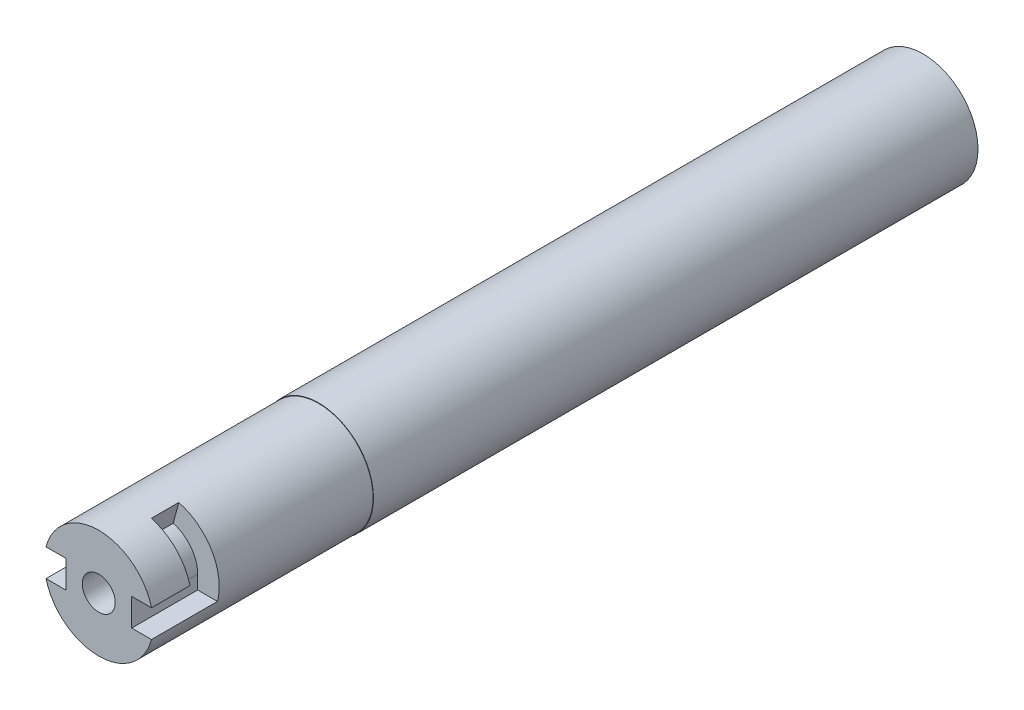
ISO-10303-21;
HEADER;
FILE_DESCRIPTION(('STEP AP214'),'2;1');
FILE_NAME('part.step','',(''),(''),'','','');
FILE_SCHEMA(('AUTOMOTIVE_DESIGN { 1 0 10303 214 1 1 1 1 }'));
ENDSEC;
DATA;
#1=APPLICATION_CONTEXT('core data for automotive mechanical design processes');
#2=APPLICATION_PROTOCOL_DEFINITION('international standard','automotive_design',2000,#1);
#3=PRODUCT_CONTEXT('',#1,'mechanical');
#4=PRODUCT('Part','Part','',(#3));
#5=PRODUCT_RELATED_PRODUCT_CATEGORY('part','',(#4));
#6=PRODUCT_DEFINITION_FORMATION('','',#4);
#7=PRODUCT_DEFINITION_CONTEXT('part definition',#1,'design');
#8=PRODUCT_DEFINITION('design','',#6,#7);
#9=PRODUCT_DEFINITION_SHAPE('','',#8);
#10=(LENGTH_UNIT() NAMED_UNIT(*) SI_UNIT(.MILLI.,.METRE.));
#11=(NAMED_UNIT(*) PLANE_ANGLE_UNIT() SI_UNIT($,.RADIAN.));
#12=(NAMED_UNIT(*) SI_UNIT($,.STERADIAN.) SOLID_ANGLE_UNIT());
#13=UNCERTAINTY_MEASURE_WITH_UNIT(LENGTH_MEASURE(1.E-05),#10,'distance_accuracy_value','');
#14=(GEOMETRIC_REPRESENTATION_CONTEXT(3) GLOBAL_UNCERTAINTY_ASSIGNED_CONTEXT((#13)) GLOBAL_UNIT_ASSIGNED_CONTEXT((#10,
#11,#12)) REPRESENTATION_CONTEXT('',''));
#15=CARTESIAN_POINT('',(0.,0.,0.));
#16=DIRECTION('',(0.,0.,1.));
#17=DIRECTION('',(1.,0.,0.));
#18=AXIS2_PLACEMENT_3D('',#15,#16,#17);
#19=CARTESIAN_POINT('',(0.,0.,95.25));
#20=DIRECTION('',(0.,0.,-1.));
#21=DIRECTION('',(-1.,0.,0.));
#22=AXIS2_PLACEMENT_3D('',#19,#20,#21);
#23=CYLINDRICAL_SURFACE('',#22,6.35);
#24=CARTESIAN_POINT('',(0.,0.,0.));
#25=DIRECTION('',(0.,0.,1.));
#26=DIRECTION('',(1.,0.,0.));
#27=AXIS2_PLACEMENT_3D('',#24,#25,#26);
#28=CIRCLE('',#27,6.35);
#29=CARTESIAN_POINT('',(6.35,0.,0.));
#30=VERTEX_POINT('',#29);
#31=EDGE_CURVE('E200',#30,#30,#28,.T.);
#32=ORIENTED_EDGE('',*,*,#31,.T.);
#33=EDGE_LOOP('',(#32));
#34=FACE_BOUND('',#33,.T.);
#35=CARTESIAN_POINT('',(0.,0.,69.85));
#36=DIRECTION('',(0.,0.,1.));
#37=DIRECTION('',(1.,0.,0.));
#38=AXIS2_PLACEMENT_3D('',#35,#36,#37);
#39=CIRCLE('',#38,6.35);
#40=CARTESIAN_POINT('',(6.35,0.,69.85));
#41=VERTEX_POINT('',#40);
#42=EDGE_CURVE('E316',#41,#41,#39,.T.);
#43=ORIENTED_EDGE('',*,*,#42,.F.);
#44=EDGE_LOOP('',(#43));
#45=FACE_BOUND('',#44,.T.);
#46=ADVANCED_FACE('F35',(#34,#45),#23,.T.);
#47=CARTESIAN_POINT('',(0.,1.5875,87.63));
#48=DIRECTION('',(0.,1.,0.));
#49=DIRECTION('',(0.,0.,1.));
#50=AXIS2_PLACEMENT_3D('',#47,#48,#49);
#51=PLANE('',#50);
#52=DIRECTION('',(0.,0.,1.));
#53=VECTOR('',#52,1.);
#54=CARTESIAN_POINT('',(6.09588093633726,1.5875,69.85));
#55=LINE('',#54,#53);
#56=CARTESIAN_POINT('',(6.09588093633726,1.5875,95.25));
#57=VERTEX_POINT('',#56);
#58=CARTESIAN_POINT('',(6.09588093633726,1.5875,90.805));
#59=VERTEX_POINT('',#58);
#60=EDGE_CURVE('E137',#57,#59,#55,.F.);
#61=ORIENTED_EDGE('',*,*,#60,.F.);
#62=DIRECTION('',(-1.,0.,0.));
#63=VECTOR('',#62,1.);
#64=CARTESIAN_POINT('',(0.,1.5875,95.25));
#65=LINE('',#64,#63);
#66=CARTESIAN_POINT('',(3.81,1.5875,95.25));
#67=VERTEX_POINT('',#66);
#68=EDGE_CURVE('E151',#57,#67,#65,.T.);
#69=ORIENTED_EDGE('',*,*,#68,.T.);
#70=DIRECTION('',(0.,0.,1.));
#71=VECTOR('',#70,1.);
#72=CARTESIAN_POINT('',(3.81,1.5875,87.63));
#73=LINE('',#72,#71);
#74=CARTESIAN_POINT('',(3.81,1.5875,90.805));
#75=VERTEX_POINT('',#74);
#76=EDGE_CURVE('E167',#75,#67,#73,.T.);
#77=ORIENTED_EDGE('',*,*,#76,.F.);
#78=DIRECTION('',(-1.,0.,0.));
#79=VECTOR('',#78,1.);
#80=CARTESIAN_POINT('',(0.,1.5875,90.805));
#81=LINE('',#80,#79);
#82=EDGE_CURVE('E152',#59,#75,#81,.T.);
#83=ORIENTED_EDGE('',*,*,#82,.F.);
#84=EDGE_LOOP('',(#61,#69,#77,#83));
#85=FACE_BOUND('',#84,.T.);
#86=ADVANCED_FACE('F149',(#85),#51,.F.);
#87=CARTESIAN_POINT('',(0.,0.,95.25));
#88=DIRECTION('',(0.,0.,1.));
#89=DIRECTION('',(1.,0.,0.));
#90=AXIS2_PLACEMENT_3D('',#87,#88,#89);
#91=PLANE('',#90);
#92=CARTESIAN_POINT('',(0.,0.,95.25));
#93=DIRECTION('',(0.,0.,1.));
#94=DIRECTION('',(1.,0.,0.));
#95=AXIS2_PLACEMENT_3D('',#92,#93,#94);
#96=CIRCLE('',#95,1.905);
#97=CARTESIAN_POINT('',(1.905,0.,95.25));
#98=VERTEX_POINT('',#97);
#99=EDGE_CURVE('E169',#98,#98,#96,.T.);
#100=ORIENTED_EDGE('',*,*,#99,.F.);
#101=EDGE_LOOP('',(#100));
#102=FACE_BOUND('',#101,.T.);
#103=ORIENTED_EDGE('',*,*,#68,.F.);
#104=CARTESIAN_POINT('',(0.,0.,95.25));
#105=DIRECTION('',(0.,0.,1.));
#106=DIRECTION('',(1.,0.,0.));
#107=AXIS2_PLACEMENT_3D('',#104,#105,#106);
#108=CIRCLE('',#107,6.2992);
#109=CARTESIAN_POINT('',(-6.09588093633726,1.5875,95.25));
#110=VERTEX_POINT('',#109);
#111=EDGE_CURVE('E134',#57,#110,#108,.T.);
#112=ORIENTED_EDGE('',*,*,#111,.T.);
#113=DIRECTION('',(1.,0.,0.));
#114=VECTOR('',#113,1.);
#115=CARTESIAN_POINT('',(0.,1.5875,95.25));
#116=LINE('',#115,#114);
#117=CARTESIAN_POINT('',(-3.81,1.5875,95.25));
#118=VERTEX_POINT('',#117);
#119=EDGE_CURVE('E182',#110,#118,#116,.T.);
#120=ORIENTED_EDGE('',*,*,#119,.T.);
#121=DIRECTION('',(0.,-1.,0.));
#122=VECTOR('',#121,1.);
#123=CARTESIAN_POINT('',(-3.81,0.,95.25));
#124=LINE('',#123,#122);
#125=CARTESIAN_POINT('',(-3.81,-1.5875,95.25));
#126=VERTEX_POINT('',#125);
#127=EDGE_CURVE('E179',#118,#126,#124,.T.);
#128=ORIENTED_EDGE('',*,*,#127,.T.);
#129=DIRECTION('',(-1.,0.,0.));
#130=VECTOR('',#129,1.);
#131=CARTESIAN_POINT('',(0.,-1.5875,95.25));
#132=LINE('',#131,#130);
#133=CARTESIAN_POINT('',(-6.09588093633726,-1.5875,95.25));
#134=VERTEX_POINT('',#133);
#135=EDGE_CURVE('E176',#126,#134,#132,.T.);
#136=ORIENTED_EDGE('',*,*,#135,.T.);
#137=CARTESIAN_POINT('',(6.09588093633726,-1.5875,95.25));
#138=VERTEX_POINT('',#137);
#139=EDGE_CURVE('E145',#134,#138,#108,.T.);
#140=ORIENTED_EDGE('',*,*,#139,.T.);
#141=DIRECTION('',(1.,0.,0.));
#142=VECTOR('',#141,1.);
#143=CARTESIAN_POINT('',(0.,-1.5875,95.25));
#144=LINE('',#143,#142);
#145=CARTESIAN_POINT('',(3.81,-1.5875,95.25));
#146=VERTEX_POINT('',#145);
#147=EDGE_CURVE('E159',#146,#138,#144,.T.);
#148=ORIENTED_EDGE('',*,*,#147,.F.);
#149=DIRECTION('',(0.,-1.,0.));
#150=VECTOR('',#149,1.);
#151=CARTESIAN_POINT('',(3.81,0.,95.25));
#152=LINE('',#151,#150);
#153=EDGE_CURVE('E56',#67,#146,#152,.T.);
#154=ORIENTED_EDGE('',*,*,#153,.F.);
#155=EDGE_LOOP('',(#103,#112,#120,#128,#136,#140,#148,#154));
#156=FACE_BOUND('',#155,.T.);
#157=ADVANCED_FACE('F156',(#102,#156),#91,.T.);
#158=CARTESIAN_POINT('',(0.,-1.5875,87.63));
#159=DIRECTION('',(0.,1.,0.));
#160=DIRECTION('',(-1.,0.,0.));
#161=AXIS2_PLACEMENT_3D('',#158,#159,#160);
#162=PLANE('',#161);
#163=DIRECTION('',(1.,0.,0.));
#164=VECTOR('',#163,1.);
#165=CARTESIAN_POINT('',(0.,-1.5875,90.805));
#166=LINE('',#165,#164);
#167=CARTESIAN_POINT('',(-6.09588093633726,-1.5875,90.805));
#168=VERTEX_POINT('',#167);
#169=CARTESIAN_POINT('',(-3.81,-1.5875,90.805));
#170=VERTEX_POINT('',#169);
#171=EDGE_CURVE('E42',#168,#170,#166,.T.);
#172=ORIENTED_EDGE('',*,*,#171,.F.);
#173=DIRECTION('',(0.,0.,1.));
#174=VECTOR('',#173,1.);
#175=CARTESIAN_POINT('',(-6.09588093633726,-1.5875,69.85));
#176=LINE('',#175,#174);
#177=EDGE_CURVE('E224',#168,#134,#176,.T.);
#178=ORIENTED_EDGE('',*,*,#177,.T.);
#179=ORIENTED_EDGE('',*,*,#135,.F.);
#180=DIRECTION('',(0.,0.,1.));
#181=VECTOR('',#180,1.);
#182=CARTESIAN_POINT('',(-3.81,-1.5875,87.63));
#183=LINE('',#182,#181);
#184=EDGE_CURVE('E187',#170,#126,#183,.T.);
#185=ORIENTED_EDGE('',*,*,#184,.F.);
#186=EDGE_LOOP('',(#172,#178,#179,#185));
#187=FACE_BOUND('',#186,.T.);
#188=ADVANCED_FACE('F223',(#187),#162,.T.);
#189=CARTESIAN_POINT('',(0.,1.5875,87.63));
#190=DIRECTION('',(0.,-1.,0.));
#191=DIRECTION('',(1.,0.,0.));
#192=AXIS2_PLACEMENT_3D('',#189,#190,#191);
#193=PLANE('',#192);
#194=ORIENTED_EDGE('',*,*,#119,.F.);
#195=DIRECTION('',(0.,0.,1.));
#196=VECTOR('',#195,1.);
#197=CARTESIAN_POINT('',(-6.09588093633726,1.5875,69.85));
#198=LINE('',#197,#196);
#199=CARTESIAN_POINT('',(-6.09588093633726,1.5875,87.63));
#200=VERTEX_POINT('',#199);
#201=EDGE_CURVE('E140',#110,#200,#198,.F.);
#202=ORIENTED_EDGE('',*,*,#201,.T.);
#203=DIRECTION('',(1.,0.,0.));
#204=VECTOR('',#203,1.);
#205=CARTESIAN_POINT('',(0.,1.5875,87.63));
#206=LINE('',#205,#204);
#207=CARTESIAN_POINT('',(-3.81,1.5875,87.63));
#208=VERTEX_POINT('',#207);
#209=EDGE_CURVE('E175',#200,#208,#206,.T.);
#210=ORIENTED_EDGE('',*,*,#209,.T.);
#211=DIRECTION('',(0.,0.,1.));
#212=VECTOR('',#211,1.);
#213=CARTESIAN_POINT('',(-3.81,1.5875,87.63));
#214=LINE('',#213,#212);
#215=EDGE_CURVE('E178',#208,#118,#214,.T.);
#216=ORIENTED_EDGE('',*,*,#215,.T.);
#217=EDGE_LOOP('',(#194,#202,#210,#216));
#218=FACE_BOUND('',#217,.T.);
#219=ADVANCED_FACE('F229',(#218),#193,.T.);
#220=CARTESIAN_POINT('',(0.,0.,87.63));
#221=DIRECTION('',(0.,0.,1.));
#222=DIRECTION('',(1.,0.,0.));
#223=AXIS2_PLACEMENT_3D('',#220,#221,#222);
#224=PLANE('',#223);
#225=ORIENTED_EDGE('',*,*,#209,.F.);
#226=CARTESIAN_POINT('',(0.,0.,87.63));
#227=DIRECTION('',(0.,0.,1.));
#228=DIRECTION('',(1.,0.,0.));
#229=AXIS2_PLACEMENT_3D('',#226,#227,#228);
#230=CIRCLE('',#229,6.2992);
#231=CARTESIAN_POINT('',(-1.63035292890977,-6.08455996496011,87.63));
#232=VERTEX_POINT('',#231);
#233=EDGE_CURVE('E235',#200,#232,#230,.T.);
#234=ORIENTED_EDGE('',*,*,#233,.T.);
#235=DIRECTION('',(-0.258819045102518,-0.965925826289069,0.));
#236=VECTOR('',#235,1.);
#237=CARTESIAN_POINT('',(-1.59131293903932,-5.9388607392366,87.63));
#238=LINE('',#237,#236);
#239=CARTESIAN_POINT('',(-0.98610056184058,-3.68017739816134,87.63));
#240=VERTEX_POINT('',#239);
#241=EDGE_CURVE('E238',#240,#232,#238,.T.);
#242=ORIENTED_EDGE('',*,*,#241,.F.);
#243=CARTESIAN_POINT('',(0.,0.,87.63));
#244=DIRECTION('',(0.,0.,-1.));
#245=DIRECTION('',(-1.,0.,0.));
#246=AXIS2_PLACEMENT_3D('',#243,#244,#245);
#247=CIRCLE('',#246,3.80999999999999);
#248=CARTESIAN_POINT('',(-3.80999999999998,0.,87.63));
#249=VERTEX_POINT('',#248);
#250=EDGE_CURVE('E237',#240,#249,#247,.T.);
#251=ORIENTED_EDGE('',*,*,#250,.T.);
#252=DIRECTION('',(0.,-1.,0.));
#253=VECTOR('',#252,1.);
#254=CARTESIAN_POINT('',(-3.81,0.,87.63));
#255=LINE('',#254,#253);
#256=EDGE_CURVE('E172',#208,#249,#255,.T.);
#257=ORIENTED_EDGE('',*,*,#256,.F.);
#258=EDGE_LOOP('',(#225,#234,#242,#251,#257));
#259=FACE_BOUND('',#258,.T.);
#260=ADVANCED_FACE('F233',(#259),#224,.T.);
#261=CARTESIAN_POINT('',(0.,-1.5875,87.63));
#262=DIRECTION('',(0.,-1.,0.));
#263=DIRECTION('',(0.,0.,-1.));
#264=AXIS2_PLACEMENT_3D('',#261,#262,#263);
#265=PLANE('',#264);
#266=DIRECTION('',(0.,0.,1.));
#267=VECTOR('',#266,1.);
#268=CARTESIAN_POINT('',(6.09588093633726,-1.5875,69.85));
#269=LINE('',#268,#267);
#270=CARTESIAN_POINT('',(6.09588093633726,-1.5875,87.63));
#271=VERTEX_POINT('',#270);
#272=EDGE_CURVE('E154',#271,#138,#269,.T.);
#273=ORIENTED_EDGE('',*,*,#272,.F.);
#274=DIRECTION('',(1.,0.,0.));
#275=VECTOR('',#274,1.);
#276=CARTESIAN_POINT('',(0.,-1.5875,87.63));
#277=LINE('',#276,#275);
#278=CARTESIAN_POINT('',(3.81,-1.5875,87.63));
#279=VERTEX_POINT('',#278);
#280=EDGE_CURVE('E161',#279,#271,#277,.T.);
#281=ORIENTED_EDGE('',*,*,#280,.F.);
#282=DIRECTION('',(0.,0.,1.));
#283=VECTOR('',#282,1.);
#284=CARTESIAN_POINT('',(3.81,-1.5875,87.63));
#285=LINE('',#284,#283);
#286=EDGE_CURVE('E170',#279,#146,#285,.T.);
#287=ORIENTED_EDGE('',*,*,#286,.T.);
#288=ORIENTED_EDGE('',*,*,#147,.T.);
#289=EDGE_LOOP('',(#273,#281,#287,#288));
#290=FACE_BOUND('',#289,.T.);
#291=ADVANCED_FACE('F268',(#290),#265,.F.);
#292=CARTESIAN_POINT('',(0.,0.,87.63));
#293=DIRECTION('',(0.,0.,1.));
#294=DIRECTION('',(1.,0.,0.));
#295=AXIS2_PLACEMENT_3D('',#292,#293,#294);
#296=PLANE('',#295);
#297=ORIENTED_EDGE('',*,*,#280,.T.);
#298=CARTESIAN_POINT('',(0.,0.,87.63));
#299=DIRECTION('',(0.,0.,1.));
#300=DIRECTION('',(1.,0.,0.));
#301=AXIS2_PLACEMENT_3D('',#298,#299,#300);
#302=CIRCLE('',#301,6.2992);
#303=CARTESIAN_POINT('',(1.63035292890979,6.0845599649601,87.63));
#304=VERTEX_POINT('',#303);
#305=EDGE_CURVE('E263',#271,#304,#302,.T.);
#306=ORIENTED_EDGE('',*,*,#305,.T.);
#307=DIRECTION('',(-0.258819045102518,-0.965925826289069,0.));
#308=VECTOR('',#307,1.);
#309=CARTESIAN_POINT('',(1.643500936401,6.13362899693558,87.63));
#310=LINE('',#309,#308);
#311=CARTESIAN_POINT('',(0.986100561840601,3.68017739816134,87.63));
#312=VERTEX_POINT('',#311);
#313=EDGE_CURVE('E276',#304,#312,#310,.T.);
#314=ORIENTED_EDGE('',*,*,#313,.T.);
#315=CARTESIAN_POINT('',(0.,0.,87.63));
#316=DIRECTION('',(0.,0.,-1.));
#317=DIRECTION('',(-1.,0.,0.));
#318=AXIS2_PLACEMENT_3D('',#315,#316,#317);
#319=CIRCLE('',#318,3.80999999999999);
#320=CARTESIAN_POINT('',(3.81,0.,87.63));
#321=VERTEX_POINT('',#320);
#322=EDGE_CURVE('E250',#312,#321,#319,.T.);
#323=ORIENTED_EDGE('',*,*,#322,.T.);
#324=DIRECTION('',(0.,-1.,0.));
#325=VECTOR('',#324,1.);
#326=CARTESIAN_POINT('',(3.81,0.,87.63));
#327=LINE('',#326,#325);
#328=EDGE_CURVE('E158',#321,#279,#327,.T.);
#329=ORIENTED_EDGE('',*,*,#328,.T.);
#330=EDGE_LOOP('',(#297,#306,#314,#323,#329));
#331=FACE_BOUND('',#330,.T.);
#332=ADVANCED_FACE('F262',(#331),#296,.T.);
#333=CARTESIAN_POINT('',(0.986100561840602,3.68017739816134,90.805));
#334=DIRECTION('',(0.,0.,-1.));
#335=DIRECTION('',(-1.,0.,0.));
#336=AXIS2_PLACEMENT_3D('',#333,#334,#335);
#337=PLANE('',#336);
#338=DIRECTION('',(0.258819045102518,0.965925826289069,0.));
#339=VECTOR('',#338,1.);
#340=CARTESIAN_POINT('',(0.986100561840602,3.68017739816134,90.805));
#341=LINE('',#340,#339);
#342=CARTESIAN_POINT('',(0.986100561840602,3.68017739816134,90.805));
#343=VERTEX_POINT('',#342);
#344=CARTESIAN_POINT('',(1.63035292890979,6.0845599649601,90.805));
#345=VERTEX_POINT('',#344);
#346=EDGE_CURVE('E281',#343,#345,#341,.T.);
#347=ORIENTED_EDGE('',*,*,#346,.T.);
#348=CARTESIAN_POINT('',(0.,0.,90.805));
#349=DIRECTION('',(0.,0.,-1.));
#350=DIRECTION('',(-1.,0.,0.));
#351=AXIS2_PLACEMENT_3D('',#348,#349,#350);
#352=CIRCLE('',#351,6.2992);
#353=EDGE_CURVE('E270',#345,#59,#352,.T.);
#354=ORIENTED_EDGE('',*,*,#353,.T.);
#355=ORIENTED_EDGE('',*,*,#82,.T.);
#356=DIRECTION('',(0.,-1.,0.));
#357=VECTOR('',#356,1.);
#358=CARTESIAN_POINT('',(3.81,0.,90.805));
#359=LINE('',#358,#357);
#360=CARTESIAN_POINT('',(3.81,0.,90.805));
#361=VERTEX_POINT('',#360);
#362=EDGE_CURVE('E221',#75,#361,#359,.T.);
#363=ORIENTED_EDGE('',*,*,#362,.T.);
#364=CARTESIAN_POINT('',(0.,0.,90.805));
#365=DIRECTION('',(0.,0.,-1.));
#366=DIRECTION('',(-1.,0.,0.));
#367=AXIS2_PLACEMENT_3D('',#364,#365,#366);
#368=CIRCLE('',#367,3.80999999999999);
#369=EDGE_CURVE('E283',#343,#361,#368,.T.);
#370=ORIENTED_EDGE('',*,*,#369,.F.);
#371=EDGE_LOOP('',(#347,#354,#355,#363,#370));
#372=FACE_BOUND('',#371,.T.);
#373=ADVANCED_FACE('F328',(#372),#337,.T.);
#374=CARTESIAN_POINT('',(0.,0.,0.));
#375=DIRECTION('',(-0.965925826289069,0.258819045102518,0.));
#376=DIRECTION('',(0.,0.,1.));
#377=AXIS2_PLACEMENT_3D('',#374,#375,#376);
#378=PLANE('',#377);
#379=DIRECTION('',(0.,0.,1.));
#380=VECTOR('',#379,1.);
#381=CARTESIAN_POINT('',(1.63035292890979,6.0845599649601,69.85));
#382=LINE('',#381,#380);
#383=EDGE_CURVE('E326',#345,#304,#382,.F.);
#384=ORIENTED_EDGE('',*,*,#383,.F.);
#385=ORIENTED_EDGE('',*,*,#346,.F.);
#386=DIRECTION('',(0.,0.,1.));
#387=VECTOR('',#386,1.);
#388=CARTESIAN_POINT('',(0.986100561840601,3.68017739816134,87.63));
#389=LINE('',#388,#387);
#390=EDGE_CURVE('E278',#312,#343,#389,.T.);
#391=ORIENTED_EDGE('',*,*,#390,.F.);
#392=ORIENTED_EDGE('',*,*,#313,.F.);
#393=EDGE_LOOP('',(#384,#385,#391,#392));
#394=FACE_BOUND('',#393,.T.);
#395=ADVANCED_FACE('F332',(#394),#378,.F.);
#396=CARTESIAN_POINT('',(-0.98610056184058,-3.68017739816134,90.805));
#397=DIRECTION('',(0.,0.,1.));
#398=DIRECTION('',(1.,0.,0.));
#399=AXIS2_PLACEMENT_3D('',#396,#397,#398);
#400=PLANE('',#399);
#401=CARTESIAN_POINT('',(0.,0.,90.805));
#402=DIRECTION('',(0.,0.,1.));
#403=DIRECTION('',(1.,0.,0.));
#404=AXIS2_PLACEMENT_3D('',#401,#402,#403);
#405=CIRCLE('',#404,6.2992);
#406=CARTESIAN_POINT('',(-1.63035292890977,-6.08455996496011,90.805));
#407=VERTEX_POINT('',#406);
#408=EDGE_CURVE('E48',#168,#407,#405,.T.);
#409=ORIENTED_EDGE('',*,*,#408,.F.);
#410=ORIENTED_EDGE('',*,*,#171,.T.);
#411=DIRECTION('',(0.,1.,0.));
#412=VECTOR('',#411,1.);
#413=CARTESIAN_POINT('',(-3.81,0.,90.805));
#414=LINE('',#413,#412);
#415=CARTESIAN_POINT('',(-3.80999999999998,0.,90.805));
#416=VERTEX_POINT('',#415);
#417=EDGE_CURVE('E183',#170,#416,#414,.T.);
#418=ORIENTED_EDGE('',*,*,#417,.T.);
#419=CARTESIAN_POINT('',(0.,0.,90.805));
#420=DIRECTION('',(0.,0.,-1.));
#421=DIRECTION('',(-1.,0.,0.));
#422=AXIS2_PLACEMENT_3D('',#419,#420,#421);
#423=CIRCLE('',#422,3.80999999999999);
#424=CARTESIAN_POINT('',(-0.98610056184058,-3.68017739816134,90.805));
#425=VERTEX_POINT('',#424);
#426=EDGE_CURVE('E242',#425,#416,#423,.T.);
#427=ORIENTED_EDGE('',*,*,#426,.F.);
#428=DIRECTION('',(0.258819045102518,0.965925826289069,0.));
#429=VECTOR('',#428,1.);
#430=CARTESIAN_POINT('',(-0.98610056184058,-3.68017739816134,90.805));
#431=LINE('',#430,#429);
#432=EDGE_CURVE('E243',#407,#425,#431,.T.);
#433=ORIENTED_EDGE('',*,*,#432,.F.);
#434=EDGE_LOOP('',(#409,#410,#418,#427,#433));
#435=FACE_BOUND('',#434,.T.);
#436=ADVANCED_FACE('F208',(#435),#400,.F.);
#437=CARTESIAN_POINT('',(0.,0.,0.));
#438=DIRECTION('',(0.965925826289069,-0.258819045102518,0.));
#439=DIRECTION('',(0.,0.,-1.));
#440=AXIS2_PLACEMENT_3D('',#437,#438,#439);
#441=PLANE('',#440);
#442=DIRECTION('',(0.,0.,1.));
#443=VECTOR('',#442,1.);
#444=CARTESIAN_POINT('',(-1.63035292890977,-6.08455996496011,69.85));
#445=LINE('',#444,#443);
#446=EDGE_CURVE('E12',#407,#232,#445,.F.);
#447=ORIENTED_EDGE('',*,*,#446,.F.);
#448=ORIENTED_EDGE('',*,*,#432,.T.);
#449=DIRECTION('',(0.,0.,-1.));
#450=VECTOR('',#449,1.);
#451=CARTESIAN_POINT('',(-0.98610056184058,-3.68017739816134,87.63));
#452=LINE('',#451,#450);
#453=EDGE_CURVE('E246',#425,#240,#452,.T.);
#454=ORIENTED_EDGE('',*,*,#453,.T.);
#455=ORIENTED_EDGE('',*,*,#241,.T.);
#456=EDGE_LOOP('',(#447,#448,#454,#455));
#457=FACE_BOUND('',#456,.T.);
#458=ADVANCED_FACE('F294',(#457),#441,.F.);
#459=CARTESIAN_POINT('',(3.81,0.,87.63));
#460=DIRECTION('',(-1.,0.,0.));
#461=DIRECTION('',(0.,0.,1.));
#462=AXIS2_PLACEMENT_3D('',#459,#460,#461);
#463=PLANE('',#462);
#464=ORIENTED_EDGE('',*,*,#362,.F.);
#465=ORIENTED_EDGE('',*,*,#76,.T.);
#466=ORIENTED_EDGE('',*,*,#153,.T.);
#467=ORIENTED_EDGE('',*,*,#286,.F.);
#468=ORIENTED_EDGE('',*,*,#328,.F.);
#469=DIRECTION('',(0.,0.,1.));
#470=VECTOR('',#469,1.);
#471=CARTESIAN_POINT('',(3.81,0.,87.63));
#472=LINE('',#471,#470);
#473=EDGE_CURVE('E256',#321,#361,#472,.T.);
#474=ORIENTED_EDGE('',*,*,#473,.T.);
#475=EDGE_LOOP('',(#464,#465,#466,#467,#468,#474));
#476=FACE_BOUND('',#475,.T.);
#477=ADVANCED_FACE('F291',(#476),#463,.F.);
#478=CARTESIAN_POINT('',(0.,0.,0.));
#479=DIRECTION('',(0.,0.,1.));
#480=DIRECTION('',(1.,0.,0.));
#481=AXIS2_PLACEMENT_3D('',#478,#479,#480);
#482=PLANE('',#481);
#483=CARTESIAN_POINT('',(0.,0.,0.));
#484=DIRECTION('',(0.,0.,-1.));
#485=DIRECTION('',(-1.,0.,0.));
#486=AXIS2_PLACEMENT_3D('',#483,#484,#485);
#487=CIRCLE('',#486,5.08);
#488=CARTESIAN_POINT('',(-5.08,0.,0.));
#489=VERTEX_POINT('',#488);
#490=EDGE_CURVE('E194',#489,#489,#487,.T.);
#491=ORIENTED_EDGE('',*,*,#490,.F.);
#492=EDGE_LOOP('',(#491));
#493=FACE_BOUND('',#492,.T.);
#494=ORIENTED_EDGE('',*,*,#31,.F.);
#495=EDGE_LOOP('',(#494));
#496=FACE_BOUND('',#495,.T.);
#497=ADVANCED_FACE('F293',(#493,#496),#482,.F.);
#498=CARTESIAN_POINT('',(0.,0.,82.55));
#499=DIRECTION('',(0.,0.,1.));
#500=DIRECTION('',(1.,0.,0.));
#501=AXIS2_PLACEMENT_3D('',#498,#499,#500);
#502=PLANE('',#501);
#503=CARTESIAN_POINT('',(0.,0.,82.55));
#504=DIRECTION('',(0.,0.,1.));
#505=DIRECTION('',(1.,0.,0.));
#506=AXIS2_PLACEMENT_3D('',#503,#504,#505);
#507=CIRCLE('',#506,1.905);
#508=CARTESIAN_POINT('',(1.905,0.,82.55));
#509=VERTEX_POINT('',#508);
#510=EDGE_CURVE('E193',#509,#509,#507,.T.);
#511=ORIENTED_EDGE('',*,*,#510,.T.);
#512=EDGE_LOOP('',(#511));
#513=FACE_BOUND('',#512,.T.);
#514=CARTESIAN_POINT('',(0.,0.,82.55));
#515=DIRECTION('',(0.,0.,1.));
#516=DIRECTION('',(1.,0.,0.));
#517=AXIS2_PLACEMENT_3D('',#514,#515,#516);
#518=CIRCLE('',#517,5.08);
#519=CARTESIAN_POINT('',(5.08,0.,82.55));
#520=VERTEX_POINT('',#519);
#521=EDGE_CURVE('E197',#520,#520,#518,.F.);
#522=ORIENTED_EDGE('',*,*,#521,.T.);
#523=EDGE_LOOP('',(#522));
#524=FACE_BOUND('',#523,.T.);
#525=ADVANCED_FACE('F300',(#513,#524),#502,.F.);
#526=CARTESIAN_POINT('',(0.,0.,109.618409793711));
#527=DIRECTION('',(0.,0.,-1.));
#528=DIRECTION('',(-1.,0.,0.));
#529=AXIS2_PLACEMENT_3D('',#526,#527,#528);
#530=CYLINDRICAL_SURFACE('',#529,5.08);
#531=ORIENTED_EDGE('',*,*,#490,.T.);
#532=EDGE_LOOP('',(#531));
#533=FACE_BOUND('',#532,.T.);
#534=ORIENTED_EDGE('',*,*,#521,.F.);
#535=EDGE_LOOP('',(#534));
#536=FACE_BOUND('',#535,.T.);
#537=ADVANCED_FACE('F366',(#533,#536),#530,.F.);
#538=CARTESIAN_POINT('',(0.,0.,-19.05));
#539=DIRECTION('',(0.,0.,1.));
#540=DIRECTION('',(1.,0.,0.));
#541=AXIS2_PLACEMENT_3D('',#538,#539,#540);
#542=CYLINDRICAL_SURFACE('',#541,1.905);
#543=ORIENTED_EDGE('',*,*,#99,.T.);
#544=EDGE_LOOP('',(#543));
#545=FACE_BOUND('',#544,.T.);
#546=ORIENTED_EDGE('',*,*,#510,.F.);
#547=EDGE_LOOP('',(#546));
#548=FACE_BOUND('',#547,.T.);
#549=ADVANCED_FACE('F363',(#545,#548),#542,.F.);
#550=CARTESIAN_POINT('',(-3.81,0.,87.63));
#551=DIRECTION('',(-1.,0.,0.));
#552=DIRECTION('',(0.,0.,1.));
#553=AXIS2_PLACEMENT_3D('',#550,#551,#552);
#554=PLANE('',#553);
#555=ORIENTED_EDGE('',*,*,#417,.F.);
#556=ORIENTED_EDGE('',*,*,#184,.T.);
#557=ORIENTED_EDGE('',*,*,#127,.F.);
#558=ORIENTED_EDGE('',*,*,#215,.F.);
#559=ORIENTED_EDGE('',*,*,#256,.T.);
#560=DIRECTION('',(0.,0.,-1.));
#561=VECTOR('',#560,1.);
#562=CARTESIAN_POINT('',(-3.80999999999998,0.,87.63));
#563=LINE('',#562,#561);
#564=EDGE_CURVE('E153',#416,#249,#563,.T.);
#565=ORIENTED_EDGE('',*,*,#564,.F.);
#566=EDGE_LOOP('',(#555,#556,#557,#558,#559,#565));
#567=FACE_BOUND('',#566,.T.);
#568=ADVANCED_FACE('F217',(#567),#554,.T.);
#569=CARTESIAN_POINT('',(0.,0.,0.));
#570=DIRECTION('',(0.,0.,-1.));
#571=DIRECTION('',(-1.,0.,0.));
#572=AXIS2_PLACEMENT_3D('',#569,#570,#571);
#573=CYLINDRICAL_SURFACE('',#572,3.80999999999999);
#574=ORIENTED_EDGE('',*,*,#369,.T.);
#575=ORIENTED_EDGE('',*,*,#473,.F.);
#576=ORIENTED_EDGE('',*,*,#322,.F.);
#577=ORIENTED_EDGE('',*,*,#390,.T.);
#578=EDGE_LOOP('',(#574,#575,#576,#577));
#579=FACE_BOUND('',#578,.T.);
#580=ADVANCED_FACE('F289',(#579),#573,.T.);
#581=CARTESIAN_POINT('',(0.,0.,0.));
#582=DIRECTION('',(0.,0.,-1.));
#583=DIRECTION('',(-1.,0.,0.));
#584=AXIS2_PLACEMENT_3D('',#581,#582,#583);
#585=CYLINDRICAL_SURFACE('',#584,3.80999999999999);
#586=ORIENTED_EDGE('',*,*,#426,.T.);
#587=ORIENTED_EDGE('',*,*,#564,.T.);
#588=ORIENTED_EDGE('',*,*,#250,.F.);
#589=ORIENTED_EDGE('',*,*,#453,.F.);
#590=EDGE_LOOP('',(#586,#587,#588,#589));
#591=FACE_BOUND('',#590,.T.);
#592=ADVANCED_FACE('F245',(#591),#585,.T.);
#593=CARTESIAN_POINT('',(0.,0.,69.85));
#594=DIRECTION('',(0.,0.,1.));
#595=DIRECTION('',(1.,0.,0.));
#596=AXIS2_PLACEMENT_3D('',#593,#594,#595);
#597=CYLINDRICAL_SURFACE('',#596,6.2992);
#598=CARTESIAN_POINT('',(0.,0.,69.85));
#599=DIRECTION('',(0.,0.,1.));
#600=DIRECTION('',(1.,0.,0.));
#601=AXIS2_PLACEMENT_3D('',#598,#599,#600);
#602=CIRCLE('',#601,6.2992);
#603=CARTESIAN_POINT('',(6.2992,0.,69.85));
#604=VERTEX_POINT('',#603);
#605=EDGE_CURVE('E144',#604,#604,#602,.T.);
#606=ORIENTED_EDGE('',*,*,#605,.T.);
#607=EDGE_LOOP('',(#606));
#608=FACE_BOUND('',#607,.T.);
#609=ORIENTED_EDGE('',*,*,#60,.T.);
#610=ORIENTED_EDGE('',*,*,#353,.F.);
#611=ORIENTED_EDGE('',*,*,#383,.T.);
#612=ORIENTED_EDGE('',*,*,#305,.F.);
#613=ORIENTED_EDGE('',*,*,#272,.T.);
#614=ORIENTED_EDGE('',*,*,#139,.F.);
#615=ORIENTED_EDGE('',*,*,#177,.F.);
#616=ORIENTED_EDGE('',*,*,#408,.T.);
#617=ORIENTED_EDGE('',*,*,#446,.T.);
#618=ORIENTED_EDGE('',*,*,#233,.F.);
#619=ORIENTED_EDGE('',*,*,#201,.F.);
#620=ORIENTED_EDGE('',*,*,#111,.F.);
#621=EDGE_LOOP('',(#609,#610,#611,#612,#613,#614,#615,#616,#617,#618,#619,#620));
#622=FACE_BOUND('',#621,.T.);
#623=ADVANCED_FACE('F136',(#608,#622),#597,.T.);
#624=CARTESIAN_POINT('',(0.,0.,69.85));
#625=DIRECTION('',(0.,0.,1.));
#626=DIRECTION('',(1.,0.,0.));
#627=AXIS2_PLACEMENT_3D('',#624,#625,#626);
#628=PLANE('',#627);
#629=ORIENTED_EDGE('',*,*,#605,.F.);
#630=EDGE_LOOP('',(#629));
#631=FACE_BOUND('',#630,.T.);
#632=ORIENTED_EDGE('',*,*,#42,.T.);
#633=EDGE_LOOP('',(#632));
#634=FACE_BOUND('',#633,.T.);
#635=ADVANCED_FACE('F342',(#631,#634),#628,.T.);
#636=CLOSED_SHELL('',(#46,#86,#157,#188,#219,#260,#291,#332,#373,#395,#436,#458,#477,#497,#525,
#537,#549,#568,#580,#592,#623,#635));
#637=MANIFOLD_SOLID_BREP('B2',#636);
#638=ADVANCED_BREP_SHAPE_REPRESENTATION('',(#18,#637),#14);
#639=SHAPE_DEFINITION_REPRESENTATION(#9,#638);
ENDSEC;
END-ISO-10303-21;
